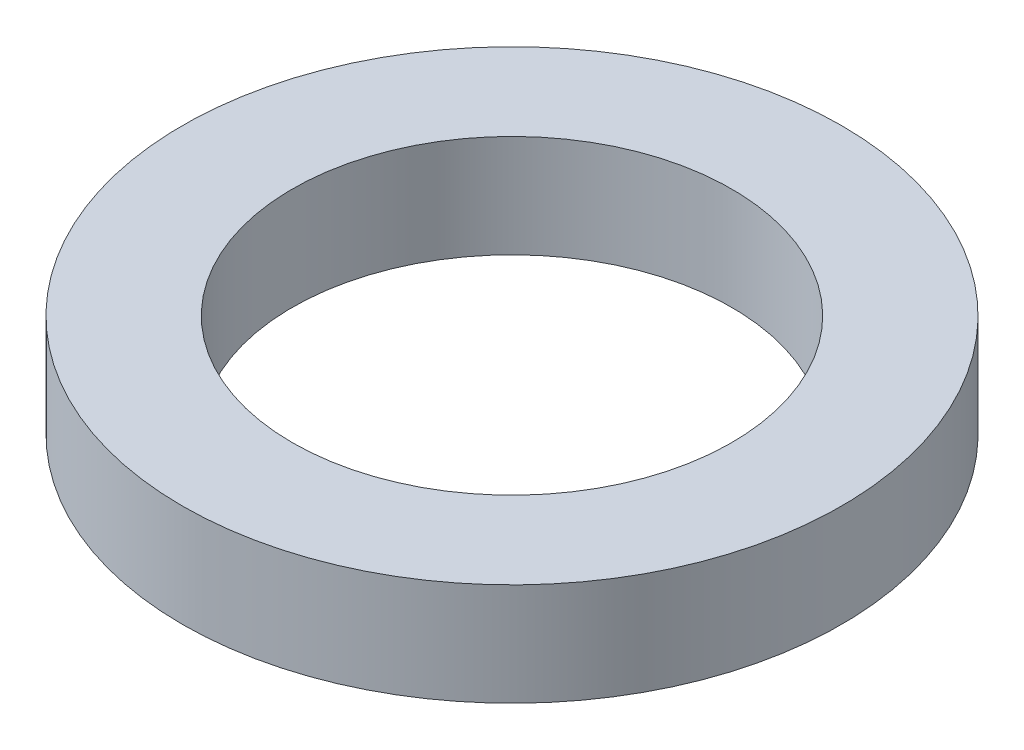
ISO-10303-21;
HEADER;
FILE_DESCRIPTION(('STEP AP214'),'2;1');
FILE_NAME('part.step','',(''),(''),'','','');
FILE_SCHEMA(('AUTOMOTIVE_DESIGN { 1 0 10303 214 1 1 1 1 }'));
ENDSEC;
DATA;
#1=APPLICATION_CONTEXT('core data for automotive mechanical design processes');
#2=APPLICATION_PROTOCOL_DEFINITION('international standard','automotive_design',2000,#1);
#3=PRODUCT_CONTEXT('',#1,'mechanical');
#4=PRODUCT('Part','Part','',(#3));
#5=PRODUCT_RELATED_PRODUCT_CATEGORY('part','',(#4));
#6=PRODUCT_DEFINITION_FORMATION('','',#4);
#7=PRODUCT_DEFINITION_CONTEXT('part definition',#1,'design');
#8=PRODUCT_DEFINITION('design','',#6,#7);
#9=PRODUCT_DEFINITION_SHAPE('','',#8);
#10=(LENGTH_UNIT() NAMED_UNIT(*) SI_UNIT(.MILLI.,.METRE.));
#11=(NAMED_UNIT(*) PLANE_ANGLE_UNIT() SI_UNIT($,.RADIAN.));
#12=(NAMED_UNIT(*) SI_UNIT($,.STERADIAN.) SOLID_ANGLE_UNIT());
#13=UNCERTAINTY_MEASURE_WITH_UNIT(LENGTH_MEASURE(1.E-05),#10,'distance_accuracy_value','');
#14=(GEOMETRIC_REPRESENTATION_CONTEXT(3) GLOBAL_UNCERTAINTY_ASSIGNED_CONTEXT((#13)) GLOBAL_UNIT_ASSIGNED_CONTEXT((#10,
#11,#12)) REPRESENTATION_CONTEXT('',''));
#15=CARTESIAN_POINT('',(0.,0.,0.));
#16=DIRECTION('',(0.,0.,1.));
#17=DIRECTION('',(1.,0.,0.));
#18=AXIS2_PLACEMENT_3D('',#15,#16,#17);
#19=CARTESIAN_POINT('',(0.,7.,0.));
#20=DIRECTION('',(0.,-1.,0.));
#21=DIRECTION('',(0.,0.,-1.));
#22=AXIS2_PLACEMENT_3D('',#19,#20,#21);
#23=CYLINDRICAL_SURFACE('',#22,22.5);
#24=CARTESIAN_POINT('',(0.,7.,0.));
#25=DIRECTION('',(0.,1.,0.));
#26=DIRECTION('',(0.,0.,1.));
#27=AXIS2_PLACEMENT_3D('',#24,#25,#26);
#28=CIRCLE('',#27,22.5);
#29=CARTESIAN_POINT('',(0.,7.,22.5));
#30=VERTEX_POINT('',#29);
#31=EDGE_CURVE('E10',#30,#30,#28,.T.);
#32=ORIENTED_EDGE('',*,*,#31,.F.);
#33=EDGE_LOOP('',(#32));
#34=FACE_BOUND('',#33,.T.);
#35=CARTESIAN_POINT('',(0.,0.,0.));
#36=DIRECTION('',(0.,1.,0.));
#37=DIRECTION('',(0.,0.,1.));
#38=AXIS2_PLACEMENT_3D('',#35,#36,#37);
#39=CIRCLE('',#38,22.5);
#40=CARTESIAN_POINT('',(0.,0.,22.5));
#41=VERTEX_POINT('',#40);
#42=EDGE_CURVE('E37',#41,#41,#39,.T.);
#43=ORIENTED_EDGE('',*,*,#42,.T.);
#44=EDGE_LOOP('',(#43));
#45=FACE_BOUND('',#44,.T.);
#46=ADVANCED_FACE('F40',(#34,#45),#23,.T.);
#47=CARTESIAN_POINT('',(0.,7.,0.));
#48=DIRECTION('',(0.,1.,0.));
#49=DIRECTION('',(0.,0.,1.));
#50=AXIS2_PLACEMENT_3D('',#47,#48,#49);
#51=PLANE('',#50);
#52=CARTESIAN_POINT('',(0.,7.,0.));
#53=DIRECTION('',(0.,1.,0.));
#54=DIRECTION('',(0.,0.,1.));
#55=AXIS2_PLACEMENT_3D('',#52,#53,#54);
#56=CIRCLE('',#55,15.);
#57=CARTESIAN_POINT('',(0.,7.,15.));
#58=VERTEX_POINT('',#57);
#59=EDGE_CURVE('E50',#58,#58,#56,.T.);
#60=ORIENTED_EDGE('',*,*,#59,.F.);
#61=EDGE_LOOP('',(#60));
#62=FACE_BOUND('',#61,.T.);
#63=ORIENTED_EDGE('',*,*,#31,.T.);
#64=EDGE_LOOP('',(#63));
#65=FACE_BOUND('',#64,.T.);
#66=ADVANCED_FACE('F59',(#62,#65),#51,.T.);
#67=CARTESIAN_POINT('',(0.,0.,0.));
#68=DIRECTION('',(0.,1.,0.));
#69=DIRECTION('',(0.,0.,1.));
#70=AXIS2_PLACEMENT_3D('',#67,#68,#69);
#71=PLANE('',#70);
#72=CARTESIAN_POINT('',(0.,0.,0.));
#73=DIRECTION('',(0.,1.,0.));
#74=DIRECTION('',(0.,0.,1.));
#75=AXIS2_PLACEMENT_3D('',#72,#73,#74);
#76=CIRCLE('',#75,15.);
#77=CARTESIAN_POINT('',(0.,0.,15.));
#78=VERTEX_POINT('',#77);
#79=EDGE_CURVE('E47',#78,#78,#76,.T.);
#80=ORIENTED_EDGE('',*,*,#79,.T.);
#81=EDGE_LOOP('',(#80));
#82=FACE_BOUND('',#81,.T.);
#83=ORIENTED_EDGE('',*,*,#42,.F.);
#84=EDGE_LOOP('',(#83));
#85=FACE_BOUND('',#84,.T.);
#86=ADVANCED_FACE('F58',(#82,#85),#71,.F.);
#87=CARTESIAN_POINT('',(0.,7.,0.));
#88=DIRECTION('',(0.,-1.,0.));
#89=DIRECTION('',(0.,0.,-1.));
#90=AXIS2_PLACEMENT_3D('',#87,#88,#89);
#91=CYLINDRICAL_SURFACE('',#90,15.);
#92=ORIENTED_EDGE('',*,*,#59,.T.);
#93=EDGE_LOOP('',(#92));
#94=FACE_BOUND('',#93,.T.);
#95=ORIENTED_EDGE('',*,*,#79,.F.);
#96=EDGE_LOOP('',(#95));
#97=FACE_BOUND('',#96,.T.);
#98=ADVANCED_FACE('F54',(#94,#97),#91,.F.);
#99=CLOSED_SHELL('',(#46,#66,#86,#98));
#100=MANIFOLD_SOLID_BREP('B2',#99);
#101=ADVANCED_BREP_SHAPE_REPRESENTATION('',(#18,#100),#14);
#102=SHAPE_DEFINITION_REPRESENTATION(#9,#101);
ENDSEC;
END-ISO-10303-21;
